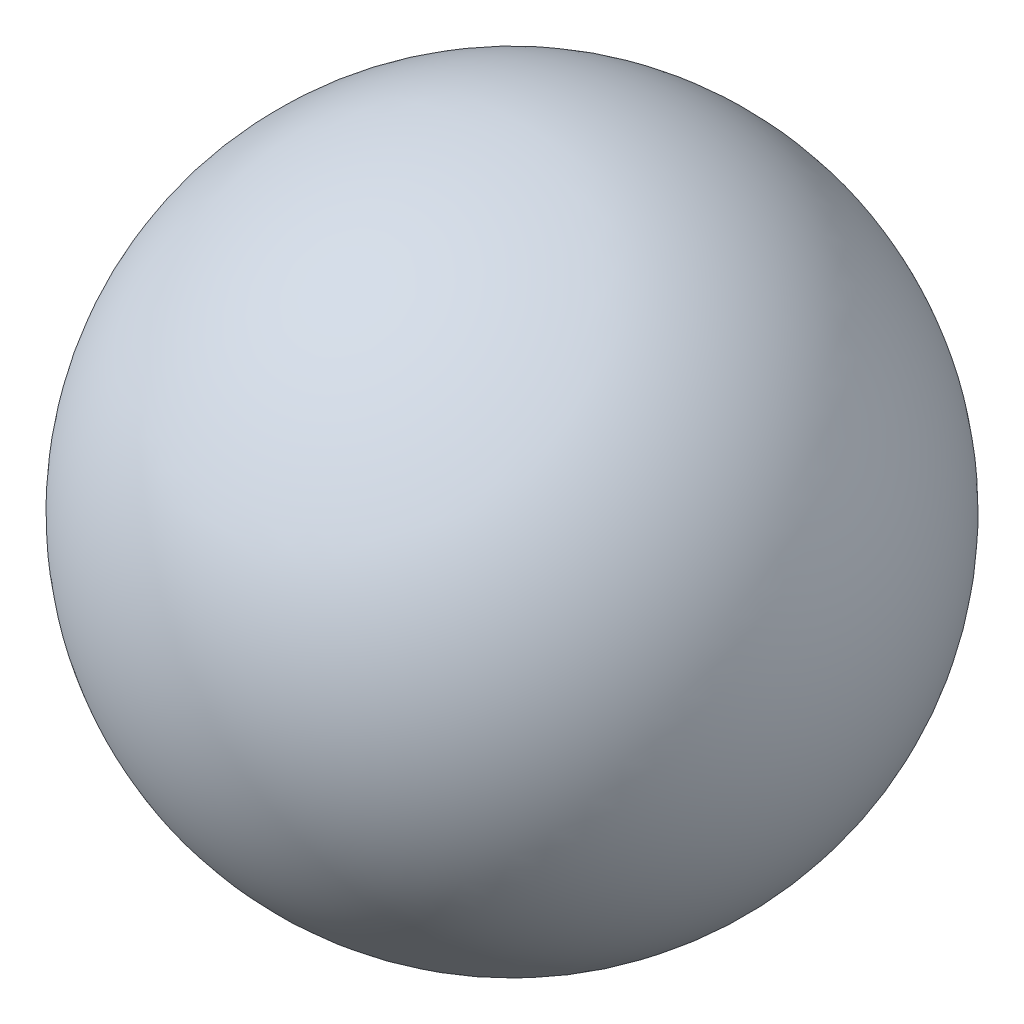
ISO-10303-21;
HEADER;
FILE_DESCRIPTION(('STEP AP214'),'2;1');
FILE_NAME('part.step','',(''),(''),'','','');
FILE_SCHEMA(('AUTOMOTIVE_DESIGN { 1 0 10303 214 1 1 1 1 }'));
ENDSEC;
DATA;
#1=APPLICATION_CONTEXT('core data for automotive mechanical design processes');
#2=APPLICATION_PROTOCOL_DEFINITION('international standard','automotive_design',2000,#1);
#3=PRODUCT_CONTEXT('',#1,'mechanical');
#4=PRODUCT('Part','Part','',(#3));
#5=PRODUCT_RELATED_PRODUCT_CATEGORY('part','',(#4));
#6=PRODUCT_DEFINITION_FORMATION('','',#4);
#7=PRODUCT_DEFINITION_CONTEXT('part definition',#1,'design');
#8=PRODUCT_DEFINITION('design','',#6,#7);
#9=PRODUCT_DEFINITION_SHAPE('','',#8);
#10=(LENGTH_UNIT() NAMED_UNIT(*) SI_UNIT(.MILLI.,.METRE.));
#11=(NAMED_UNIT(*) PLANE_ANGLE_UNIT() SI_UNIT($,.RADIAN.));
#12=(NAMED_UNIT(*) SI_UNIT($,.STERADIAN.) SOLID_ANGLE_UNIT());
#13=UNCERTAINTY_MEASURE_WITH_UNIT(LENGTH_MEASURE(1.E-05),#10,'distance_accuracy_value','');
#14=(GEOMETRIC_REPRESENTATION_CONTEXT(3) GLOBAL_UNCERTAINTY_ASSIGNED_CONTEXT((#13)) GLOBAL_UNIT_ASSIGNED_CONTEXT((#10,
#11,#12)) REPRESENTATION_CONTEXT('',''));
#15=CARTESIAN_POINT('',(0.,0.,0.));
#16=DIRECTION('',(0.,0.,1.));
#17=DIRECTION('',(1.,0.,0.));
#18=AXIS2_PLACEMENT_3D('',#15,#16,#17);
#19=CARTESIAN_POINT('',(6.35252960510324,-2.,9.8847290107664));
#20=DIRECTION('',(0.,0.,1.));
#21=DIRECTION('',(1.,0.,0.));
#22=AXIS2_PLACEMENT_3D('',#19,#20,#21);
#23=SPHERICAL_SURFACE('',#22,1.05);
#24=CARTESIAN_POINT('',(6.35252960510324,-2.,10.9347290107664));
#25=VERTEX_POINT('',#24);
#26=VERTEX_LOOP('',#25);
#27=FACE_BOUND('',#26,.T.);
#28=ADVANCED_FACE('F12',(#27),#23,.T.);
#29=CLOSED_SHELL('',(#28));
#30=MANIFOLD_SOLID_BREP('B1',#29);
#31=ADVANCED_BREP_SHAPE_REPRESENTATION('',(#18,#30),#14);
#32=SHAPE_DEFINITION_REPRESENTATION(#9,#31);
ENDSEC;
END-ISO-10303-21;
